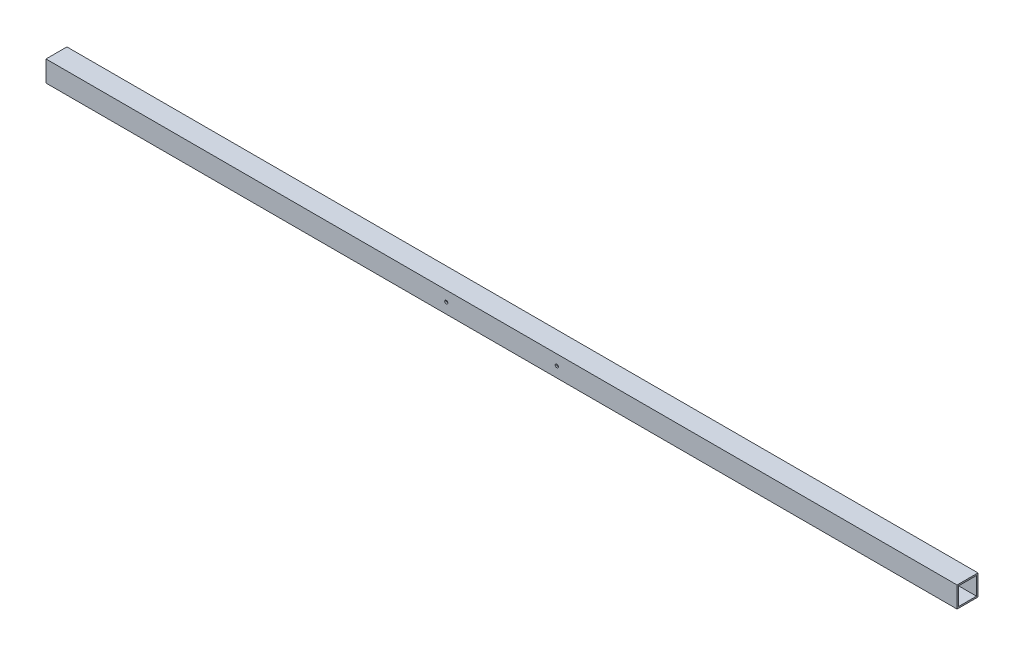
ISO-10303-21;
HEADER;
FILE_DESCRIPTION(('STEP AP214'),'2;1');
FILE_NAME('part.step','',(''),(''),'','','');
FILE_SCHEMA(('AUTOMOTIVE_DESIGN { 1 0 10303 214 1 1 1 1 }'));
ENDSEC;
DATA;
#1=APPLICATION_CONTEXT('core data for automotive mechanical design processes');
#2=APPLICATION_PROTOCOL_DEFINITION('international standard','automotive_design',2000,#1);
#3=PRODUCT_CONTEXT('',#1,'mechanical');
#4=PRODUCT('Part','Part','',(#3));
#5=PRODUCT_RELATED_PRODUCT_CATEGORY('part','',(#4));
#6=PRODUCT_DEFINITION_FORMATION('','',#4);
#7=PRODUCT_DEFINITION_CONTEXT('part definition',#1,'design');
#8=PRODUCT_DEFINITION('design','',#6,#7);
#9=PRODUCT_DEFINITION_SHAPE('','',#8);
#10=(LENGTH_UNIT() NAMED_UNIT(*) SI_UNIT(.MILLI.,.METRE.));
#11=(NAMED_UNIT(*) PLANE_ANGLE_UNIT() SI_UNIT($,.RADIAN.));
#12=(NAMED_UNIT(*) SI_UNIT($,.STERADIAN.) SOLID_ANGLE_UNIT());
#13=UNCERTAINTY_MEASURE_WITH_UNIT(LENGTH_MEASURE(1.E-05),#10,'distance_accuracy_value','');
#14=(GEOMETRIC_REPRESENTATION_CONTEXT(3) GLOBAL_UNCERTAINTY_ASSIGNED_CONTEXT((#13)) GLOBAL_UNIT_ASSIGNED_CONTEXT((#10,
#11,#12)) REPRESENTATION_CONTEXT('',''));
#15=CARTESIAN_POINT('',(0.,0.,0.));
#16=DIRECTION('',(0.,0.,1.));
#17=DIRECTION('',(1.,0.,0.));
#18=AXIS2_PLACEMENT_3D('',#15,#16,#17);
#19=CARTESIAN_POINT('',(1936.75,0.,0.));
#20=DIRECTION('',(-1.,0.,0.));
#21=DIRECTION('',(0.,0.,1.));
#22=AXIS2_PLACEMENT_3D('',#19,#20,#21);
#23=PLANE('',#22);
#24=DIRECTION('',(0.,-1.,0.));
#25=VECTOR('',#24,1.);
#26=CARTESIAN_POINT('',(1936.75,0.,0.));
#27=LINE('',#26,#25);
#28=CARTESIAN_POINT('',(1936.75,44.45,0.));
#29=VERTEX_POINT('',#28);
#30=CARTESIAN_POINT('',(1936.75,0.,0.));
#31=VERTEX_POINT('',#30);
#32=EDGE_CURVE('E144',#29,#31,#27,.T.);
#33=ORIENTED_EDGE('',*,*,#32,.T.);
#34=DIRECTION('',(0.,0.,-1.));
#35=VECTOR('',#34,1.);
#36=CARTESIAN_POINT('',(1936.75,0.,0.));
#37=LINE('',#36,#35);
#38=CARTESIAN_POINT('',(1936.75,0.,-44.45));
#39=VERTEX_POINT('',#38);
#40=EDGE_CURVE('E147',#31,#39,#37,.T.);
#41=ORIENTED_EDGE('',*,*,#40,.T.);
#42=DIRECTION('',(0.,1.,0.));
#43=VECTOR('',#42,1.);
#44=CARTESIAN_POINT('',(1936.75,0.,-44.45));
#45=LINE('',#44,#43);
#46=CARTESIAN_POINT('',(1936.75,44.45,-44.45));
#47=VERTEX_POINT('',#46);
#48=EDGE_CURVE('E150',#39,#47,#45,.T.);
#49=ORIENTED_EDGE('',*,*,#48,.T.);
#50=DIRECTION('',(0.,0.,1.));
#51=VECTOR('',#50,1.);
#52=CARTESIAN_POINT('',(1936.75,44.45,0.));
#53=LINE('',#52,#51);
#54=EDGE_CURVE('E152',#47,#29,#53,.T.);
#55=ORIENTED_EDGE('',*,*,#54,.T.);
#56=EDGE_LOOP('',(#33,#41,#49,#55));
#57=FACE_BOUND('',#56,.T.);
#58=DIRECTION('',(0.,-1.,0.));
#59=VECTOR('',#58,1.);
#60=CARTESIAN_POINT('',(1936.75,41.275,-3.175));
#61=LINE('',#60,#59);
#62=CARTESIAN_POINT('',(1936.75,41.275,-3.175));
#63=VERTEX_POINT('',#62);
#64=CARTESIAN_POINT('',(1936.75,3.175,-3.175));
#65=VERTEX_POINT('',#64);
#66=EDGE_CURVE('E106',#63,#65,#61,.T.);
#67=ORIENTED_EDGE('',*,*,#66,.F.);
#68=DIRECTION('',(0.,0.,1.));
#69=VECTOR('',#68,1.);
#70=CARTESIAN_POINT('',(1936.75,41.275,-3.175));
#71=LINE('',#70,#69);
#72=CARTESIAN_POINT('',(1936.75,41.275,-41.275));
#73=VERTEX_POINT('',#72);
#74=EDGE_CURVE('E128',#73,#63,#71,.T.);
#75=ORIENTED_EDGE('',*,*,#74,.F.);
#76=DIRECTION('',(0.,1.,0.));
#77=VECTOR('',#76,1.);
#78=CARTESIAN_POINT('',(1936.75,41.275,-41.275));
#79=LINE('',#78,#77);
#80=CARTESIAN_POINT('',(1936.75,3.175,-41.275));
#81=VERTEX_POINT('',#80);
#82=EDGE_CURVE('E126',#81,#73,#79,.T.);
#83=ORIENTED_EDGE('',*,*,#82,.F.);
#84=DIRECTION('',(0.,0.,-1.));
#85=VECTOR('',#84,1.);
#86=CARTESIAN_POINT('',(1936.75,3.175,-3.175));
#87=LINE('',#86,#85);
#88=EDGE_CURVE('E114',#65,#81,#87,.T.);
#89=ORIENTED_EDGE('',*,*,#88,.F.);
#90=EDGE_LOOP('',(#67,#75,#83,#89));
#91=FACE_BOUND('',#90,.T.);
#92=ADVANCED_FACE('F39',(#57,#91),#23,.F.);
#93=CARTESIAN_POINT('',(0.,0.,0.));
#94=DIRECTION('',(-1.,0.,0.));
#95=DIRECTION('',(0.,0.,1.));
#96=AXIS2_PLACEMENT_3D('',#93,#94,#95);
#97=PLANE('',#96);
#98=DIRECTION('',(0.,-1.,0.));
#99=VECTOR('',#98,1.);
#100=CARTESIAN_POINT('',(0.,0.,0.));
#101=LINE('',#100,#99);
#102=CARTESIAN_POINT('',(0.,44.45,0.));
#103=VERTEX_POINT('',#102);
#104=CARTESIAN_POINT('',(0.,0.,0.));
#105=VERTEX_POINT('',#104);
#106=EDGE_CURVE('E122',#103,#105,#101,.T.);
#107=ORIENTED_EDGE('',*,*,#106,.F.);
#108=DIRECTION('',(0.,0.,1.));
#109=VECTOR('',#108,1.);
#110=CARTESIAN_POINT('',(0.,44.45,0.));
#111=LINE('',#110,#109);
#112=CARTESIAN_POINT('',(0.,44.45,-44.45));
#113=VERTEX_POINT('',#112);
#114=EDGE_CURVE('E148',#113,#103,#111,.T.);
#115=ORIENTED_EDGE('',*,*,#114,.F.);
#116=DIRECTION('',(0.,1.,0.));
#117=VECTOR('',#116,1.);
#118=CARTESIAN_POINT('',(0.,0.,-44.45));
#119=LINE('',#118,#117);
#120=CARTESIAN_POINT('',(0.,0.,-44.45));
#121=VERTEX_POINT('',#120);
#122=EDGE_CURVE('E159',#121,#113,#119,.T.);
#123=ORIENTED_EDGE('',*,*,#122,.F.);
#124=DIRECTION('',(0.,0.,-1.));
#125=VECTOR('',#124,1.);
#126=CARTESIAN_POINT('',(0.,0.,0.));
#127=LINE('',#126,#125);
#128=EDGE_CURVE('E157',#105,#121,#127,.T.);
#129=ORIENTED_EDGE('',*,*,#128,.F.);
#130=EDGE_LOOP('',(#107,#115,#123,#129));
#131=FACE_BOUND('',#130,.T.);
#132=DIRECTION('',(0.,0.,1.));
#133=VECTOR('',#132,1.);
#134=CARTESIAN_POINT('',(0.,41.275,-3.175));
#135=LINE('',#134,#133);
#136=CARTESIAN_POINT('',(0.,41.275,-41.275));
#137=VERTEX_POINT('',#136);
#138=CARTESIAN_POINT('',(0.,41.275,-3.175));
#139=VERTEX_POINT('',#138);
#140=EDGE_CURVE('E115',#137,#139,#135,.T.);
#141=ORIENTED_EDGE('',*,*,#140,.T.);
#142=DIRECTION('',(0.,-1.,0.));
#143=VECTOR('',#142,1.);
#144=CARTESIAN_POINT('',(0.,41.275,-3.175));
#145=LINE('',#144,#143);
#146=CARTESIAN_POINT('',(0.,3.175,-3.175));
#147=VERTEX_POINT('',#146);
#148=EDGE_CURVE('E64',#139,#147,#145,.T.);
#149=ORIENTED_EDGE('',*,*,#148,.T.);
#150=DIRECTION('',(0.,0.,-1.));
#151=VECTOR('',#150,1.);
#152=CARTESIAN_POINT('',(0.,3.175,-3.175));
#153=LINE('',#152,#151);
#154=CARTESIAN_POINT('',(0.,3.175,-41.275));
#155=VERTEX_POINT('',#154);
#156=EDGE_CURVE('E121',#147,#155,#153,.T.);
#157=ORIENTED_EDGE('',*,*,#156,.T.);
#158=DIRECTION('',(0.,1.,0.));
#159=VECTOR('',#158,1.);
#160=CARTESIAN_POINT('',(0.,41.275,-41.275));
#161=LINE('',#160,#159);
#162=EDGE_CURVE('E136',#155,#137,#161,.T.);
#163=ORIENTED_EDGE('',*,*,#162,.T.);
#164=EDGE_LOOP('',(#141,#149,#157,#163));
#165=FACE_BOUND('',#164,.T.);
#166=ADVANCED_FACE('F197',(#131,#165),#97,.T.);
#167=CARTESIAN_POINT('',(1936.75,0.,0.));
#168=DIRECTION('',(0.,0.,-1.));
#169=DIRECTION('',(-1.,0.,0.));
#170=AXIS2_PLACEMENT_3D('',#167,#168,#169);
#171=PLANE('',#170);
#172=CARTESIAN_POINT('',(850.9,22.2249999999998,0.));
#173=DIRECTION('',(0.,0.,1.));
#174=DIRECTION('',(1.,0.,0.));
#175=AXIS2_PLACEMENT_3D('',#172,#173,#174);
#176=CIRCLE('',#175,3.373501);
#177=CARTESIAN_POINT('',(854.273501,22.2249999999998,0.));
#178=VERTEX_POINT('',#177);
#179=EDGE_CURVE('E188',#178,#178,#176,.T.);
#180=ORIENTED_EDGE('',*,*,#179,.F.);
#181=EDGE_LOOP('',(#180));
#182=FACE_BOUND('',#181,.T.);
#183=CARTESIAN_POINT('',(1085.85,22.2249999999998,0.));
#184=DIRECTION('',(0.,0.,1.));
#185=DIRECTION('',(1.,0.,0.));
#186=AXIS2_PLACEMENT_3D('',#183,#184,#185);
#187=CIRCLE('',#186,3.373501);
#188=CARTESIAN_POINT('',(1089.223501,22.2249999999998,0.));
#189=VERTEX_POINT('',#188);
#190=EDGE_CURVE('E175',#189,#189,#187,.T.);
#191=ORIENTED_EDGE('',*,*,#190,.F.);
#192=EDGE_LOOP('',(#191));
#193=FACE_BOUND('',#192,.T.);
#194=ORIENTED_EDGE('',*,*,#106,.T.);
#195=DIRECTION('',(-1.,0.,0.));
#196=VECTOR('',#195,1.);
#197=CARTESIAN_POINT('',(1936.75,0.,0.));
#198=LINE('',#197,#196);
#199=EDGE_CURVE('E11',#31,#105,#198,.T.);
#200=ORIENTED_EDGE('',*,*,#199,.F.);
#201=ORIENTED_EDGE('',*,*,#32,.F.);
#202=DIRECTION('',(-1.,0.,0.));
#203=VECTOR('',#202,1.);
#204=CARTESIAN_POINT('',(1936.75,44.45,0.));
#205=LINE('',#204,#203);
#206=EDGE_CURVE('E154',#29,#103,#205,.T.);
#207=ORIENTED_EDGE('',*,*,#206,.T.);
#208=EDGE_LOOP('',(#194,#200,#201,#207));
#209=FACE_BOUND('',#208,.T.);
#210=ADVANCED_FACE('F41',(#182,#193,#209),#171,.F.);
#211=CARTESIAN_POINT('',(1936.75,0.,0.));
#212=DIRECTION('',(0.,1.,0.));
#213=DIRECTION('',(0.,0.,1.));
#214=AXIS2_PLACEMENT_3D('',#211,#212,#213);
#215=PLANE('',#214);
#216=ORIENTED_EDGE('',*,*,#128,.T.);
#217=DIRECTION('',(-1.,0.,0.));
#218=VECTOR('',#217,1.);
#219=CARTESIAN_POINT('',(1936.75,0.,-44.45));
#220=LINE('',#219,#218);
#221=EDGE_CURVE('E48',#39,#121,#220,.T.);
#222=ORIENTED_EDGE('',*,*,#221,.F.);
#223=ORIENTED_EDGE('',*,*,#40,.F.);
#224=ORIENTED_EDGE('',*,*,#199,.T.);
#225=EDGE_LOOP('',(#216,#222,#223,#224));
#226=FACE_BOUND('',#225,.T.);
#227=ADVANCED_FACE('F196',(#226),#215,.F.);
#228=CARTESIAN_POINT('',(1936.75,0.,-44.45));
#229=DIRECTION('',(0.,0.,1.));
#230=DIRECTION('',(1.,0.,0.));
#231=AXIS2_PLACEMENT_3D('',#228,#229,#230);
#232=PLANE('',#231);
#233=CARTESIAN_POINT('',(850.9,22.2249999999998,-44.45));
#234=DIRECTION('',(0.,0.,1.));
#235=DIRECTION('',(1.,0.,0.));
#236=AXIS2_PLACEMENT_3D('',#233,#234,#235);
#237=CIRCLE('',#236,3.373501);
#238=CARTESIAN_POINT('',(854.273501,22.2249999999998,-44.45));
#239=VERTEX_POINT('',#238);
#240=EDGE_CURVE('E185',#239,#239,#237,.T.);
#241=ORIENTED_EDGE('',*,*,#240,.T.);
#242=EDGE_LOOP('',(#241));
#243=FACE_BOUND('',#242,.T.);
#244=CARTESIAN_POINT('',(1085.85,22.2249999999998,-44.45));
#245=DIRECTION('',(0.,0.,1.));
#246=DIRECTION('',(1.,0.,0.));
#247=AXIS2_PLACEMENT_3D('',#244,#245,#246);
#248=CIRCLE('',#247,3.373501);
#249=CARTESIAN_POINT('',(1089.223501,22.2249999999998,-44.45));
#250=VERTEX_POINT('',#249);
#251=EDGE_CURVE('E170',#250,#250,#248,.T.);
#252=ORIENTED_EDGE('',*,*,#251,.T.);
#253=EDGE_LOOP('',(#252));
#254=FACE_BOUND('',#253,.T.);
#255=ORIENTED_EDGE('',*,*,#122,.T.);
#256=DIRECTION('',(-1.,0.,0.));
#257=VECTOR('',#256,1.);
#258=CARTESIAN_POINT('',(1936.75,44.45,-44.45));
#259=LINE('',#258,#257);
#260=EDGE_CURVE('E164',#47,#113,#259,.T.);
#261=ORIENTED_EDGE('',*,*,#260,.F.);
#262=ORIENTED_EDGE('',*,*,#48,.F.);
#263=ORIENTED_EDGE('',*,*,#221,.T.);
#264=EDGE_LOOP('',(#255,#261,#262,#263));
#265=FACE_BOUND('',#264,.T.);
#266=ADVANCED_FACE('F217',(#243,#254,#265),#232,.F.);
#267=CARTESIAN_POINT('',(1936.75,44.45,0.));
#268=DIRECTION('',(0.,-1.,0.));
#269=DIRECTION('',(0.,0.,-1.));
#270=AXIS2_PLACEMENT_3D('',#267,#268,#269);
#271=PLANE('',#270);
#272=ORIENTED_EDGE('',*,*,#114,.T.);
#273=ORIENTED_EDGE('',*,*,#206,.F.);
#274=ORIENTED_EDGE('',*,*,#54,.F.);
#275=ORIENTED_EDGE('',*,*,#260,.T.);
#276=EDGE_LOOP('',(#272,#273,#274,#275));
#277=FACE_BOUND('',#276,.T.);
#278=ADVANCED_FACE('F215',(#277),#271,.F.);
#279=CARTESIAN_POINT('',(1936.75,41.275,-3.175));
#280=DIRECTION('',(0.,0.,-1.));
#281=DIRECTION('',(0.,1.,0.));
#282=AXIS2_PLACEMENT_3D('',#279,#280,#281);
#283=PLANE('',#282);
#284=CARTESIAN_POINT('',(850.9,22.2249999999998,-3.175));
#285=DIRECTION('',(0.,0.,-1.));
#286=DIRECTION('',(0.,1.,0.));
#287=AXIS2_PLACEMENT_3D('',#284,#285,#286);
#288=CIRCLE('',#287,3.373501);
#289=CARTESIAN_POINT('',(850.9,25.5985009999998,-3.175));
#290=VERTEX_POINT('',#289);
#291=EDGE_CURVE('E43',#290,#290,#288,.T.);
#292=ORIENTED_EDGE('',*,*,#291,.F.);
#293=EDGE_LOOP('',(#292));
#294=FACE_BOUND('',#293,.T.);
#295=CARTESIAN_POINT('',(1085.85,22.2249999999998,-3.175));
#296=DIRECTION('',(0.,0.,-1.));
#297=DIRECTION('',(0.,1.,0.));
#298=AXIS2_PLACEMENT_3D('',#295,#296,#297);
#299=CIRCLE('',#298,3.373501);
#300=CARTESIAN_POINT('',(1085.85,25.5985009999998,-3.175));
#301=VERTEX_POINT('',#300);
#302=EDGE_CURVE('E134',#301,#301,#299,.T.);
#303=ORIENTED_EDGE('',*,*,#302,.F.);
#304=EDGE_LOOP('',(#303));
#305=FACE_BOUND('',#304,.T.);
#306=ORIENTED_EDGE('',*,*,#148,.F.);
#307=DIRECTION('',(-1.,0.,0.));
#308=VECTOR('',#307,1.);
#309=CARTESIAN_POINT('',(1936.75,41.275,-3.175));
#310=LINE('',#309,#308);
#311=EDGE_CURVE('E110',#63,#139,#310,.T.);
#312=ORIENTED_EDGE('',*,*,#311,.F.);
#313=ORIENTED_EDGE('',*,*,#66,.T.);
#314=DIRECTION('',(-1.,0.,0.));
#315=VECTOR('',#314,1.);
#316=CARTESIAN_POINT('',(1936.75,3.175,-3.175));
#317=LINE('',#316,#315);
#318=EDGE_CURVE('E109',#65,#147,#317,.T.);
#319=ORIENTED_EDGE('',*,*,#318,.T.);
#320=EDGE_LOOP('',(#306,#312,#313,#319));
#321=FACE_BOUND('',#320,.T.);
#322=ADVANCED_FACE('F108',(#294,#305,#321),#283,.T.);
#323=CARTESIAN_POINT('',(1936.75,3.175,-3.175));
#324=DIRECTION('',(0.,1.,0.));
#325=DIRECTION('',(0.,0.,1.));
#326=AXIS2_PLACEMENT_3D('',#323,#324,#325);
#327=PLANE('',#326);
#328=ORIENTED_EDGE('',*,*,#156,.F.);
#329=ORIENTED_EDGE('',*,*,#318,.F.);
#330=ORIENTED_EDGE('',*,*,#88,.T.);
#331=DIRECTION('',(-1.,0.,0.));
#332=VECTOR('',#331,1.);
#333=CARTESIAN_POINT('',(1936.75,3.175,-41.275));
#334=LINE('',#333,#332);
#335=EDGE_CURVE('E123',#81,#155,#334,.T.);
#336=ORIENTED_EDGE('',*,*,#335,.T.);
#337=EDGE_LOOP('',(#328,#329,#330,#336));
#338=FACE_BOUND('',#337,.T.);
#339=ADVANCED_FACE('F118',(#338),#327,.T.);
#340=CARTESIAN_POINT('',(1936.75,41.275,-41.275));
#341=DIRECTION('',(0.,0.,1.));
#342=DIRECTION('',(0.,-1.,0.));
#343=AXIS2_PLACEMENT_3D('',#340,#341,#342);
#344=PLANE('',#343);
#345=CARTESIAN_POINT('',(850.9,22.2249999999998,-41.275));
#346=DIRECTION('',(0.,0.,1.));
#347=DIRECTION('',(0.,-1.,0.));
#348=AXIS2_PLACEMENT_3D('',#345,#346,#347);
#349=CIRCLE('',#348,3.373501);
#350=CARTESIAN_POINT('',(850.9,18.8514989999998,-41.275));
#351=VERTEX_POINT('',#350);
#352=EDGE_CURVE('E180',#351,#351,#349,.T.);
#353=ORIENTED_EDGE('',*,*,#352,.F.);
#354=EDGE_LOOP('',(#353));
#355=FACE_BOUND('',#354,.T.);
#356=CARTESIAN_POINT('',(1085.85,22.2249999999998,-41.275));
#357=DIRECTION('',(0.,0.,1.));
#358=DIRECTION('',(0.,-1.,0.));
#359=AXIS2_PLACEMENT_3D('',#356,#357,#358);
#360=CIRCLE('',#359,3.373501);
#361=CARTESIAN_POINT('',(1085.85,18.8514989999998,-41.275));
#362=VERTEX_POINT('',#361);
#363=EDGE_CURVE('E168',#362,#362,#360,.T.);
#364=ORIENTED_EDGE('',*,*,#363,.F.);
#365=EDGE_LOOP('',(#364));
#366=FACE_BOUND('',#365,.T.);
#367=ORIENTED_EDGE('',*,*,#162,.F.);
#368=ORIENTED_EDGE('',*,*,#335,.F.);
#369=ORIENTED_EDGE('',*,*,#82,.T.);
#370=DIRECTION('',(-1.,0.,0.));
#371=VECTOR('',#370,1.);
#372=CARTESIAN_POINT('',(1936.75,41.275,-41.275));
#373=LINE('',#372,#371);
#374=EDGE_CURVE('E56',#73,#137,#373,.T.);
#375=ORIENTED_EDGE('',*,*,#374,.T.);
#376=EDGE_LOOP('',(#367,#368,#369,#375));
#377=FACE_BOUND('',#376,.T.);
#378=ADVANCED_FACE('F238',(#355,#366,#377),#344,.T.);
#379=CARTESIAN_POINT('',(1936.75,41.275,-3.175));
#380=DIRECTION('',(0.,-1.,0.));
#381=DIRECTION('',(0.,0.,-1.));
#382=AXIS2_PLACEMENT_3D('',#379,#380,#381);
#383=PLANE('',#382);
#384=ORIENTED_EDGE('',*,*,#140,.F.);
#385=ORIENTED_EDGE('',*,*,#374,.F.);
#386=ORIENTED_EDGE('',*,*,#74,.T.);
#387=ORIENTED_EDGE('',*,*,#311,.T.);
#388=EDGE_LOOP('',(#384,#385,#386,#387));
#389=FACE_BOUND('',#388,.T.);
#390=ADVANCED_FACE('F241',(#389),#383,.T.);
#391=CARTESIAN_POINT('',(1085.85,22.2249999999998,0.));
#392=DIRECTION('',(0.,0.,1.));
#393=DIRECTION('',(1.,0.,0.));
#394=AXIS2_PLACEMENT_3D('',#391,#392,#393);
#395=CYLINDRICAL_SURFACE('',#394,3.373501);
#396=ORIENTED_EDGE('',*,*,#363,.T.);
#397=EDGE_LOOP('',(#396));
#398=FACE_BOUND('',#397,.T.);
#399=ORIENTED_EDGE('',*,*,#251,.F.);
#400=EDGE_LOOP('',(#399));
#401=FACE_BOUND('',#400,.T.);
#402=ADVANCED_FACE('F245',(#398,#401),#395,.F.);
#403=ORIENTED_EDGE('',*,*,#302,.T.);
#404=EDGE_LOOP('',(#403));
#405=FACE_BOUND('',#404,.T.);
#406=ORIENTED_EDGE('',*,*,#190,.T.);
#407=EDGE_LOOP('',(#406));
#408=FACE_BOUND('',#407,.T.);
#409=ADVANCED_FACE('F248',(#405,#408),#395,.F.);
#410=CARTESIAN_POINT('',(850.9,22.2249999999998,0.));
#411=DIRECTION('',(0.,0.,1.));
#412=DIRECTION('',(1.,0.,0.));
#413=AXIS2_PLACEMENT_3D('',#410,#411,#412);
#414=CYLINDRICAL_SURFACE('',#413,3.373501);
#415=ORIENTED_EDGE('',*,*,#291,.T.);
#416=EDGE_LOOP('',(#415));
#417=FACE_BOUND('',#416,.T.);
#418=ORIENTED_EDGE('',*,*,#179,.T.);
#419=EDGE_LOOP('',(#418));
#420=FACE_BOUND('',#419,.T.);
#421=ADVANCED_FACE('F192',(#417,#420),#414,.F.);
#422=ORIENTED_EDGE('',*,*,#352,.T.);
#423=EDGE_LOOP('',(#422));
#424=FACE_BOUND('',#423,.T.);
#425=ORIENTED_EDGE('',*,*,#240,.F.);
#426=EDGE_LOOP('',(#425));
#427=FACE_BOUND('',#426,.T.);
#428=ADVANCED_FACE('F250',(#424,#427),#414,.F.);
#429=CLOSED_SHELL('',(#92,#166,#210,#227,#266,#278,#322,#339,#378,#390,#402,#409,#421,#428));
#430=MANIFOLD_SOLID_BREP('B2',#429);
#431=ADVANCED_BREP_SHAPE_REPRESENTATION('',(#18,#430),#14);
#432=SHAPE_DEFINITION_REPRESENTATION(#9,#431);
ENDSEC;
END-ISO-10303-21;
